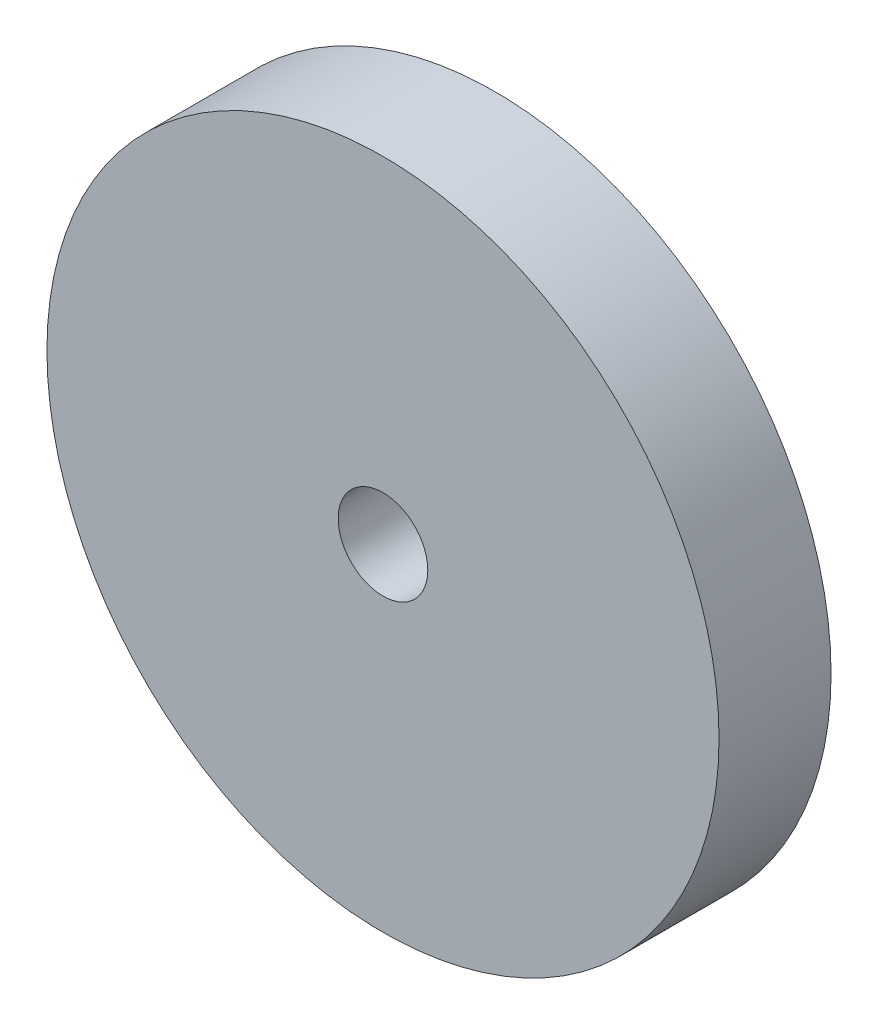
ISO-10303-21;
HEADER;
FILE_DESCRIPTION(('STEP AP214'),'2;1');
FILE_NAME('part.step','',(''),(''),'','','');
FILE_SCHEMA(('AUTOMOTIVE_DESIGN { 1 0 10303 214 1 1 1 1 }'));
ENDSEC;
DATA;
#1=APPLICATION_CONTEXT('core data for automotive mechanical design processes');
#2=APPLICATION_PROTOCOL_DEFINITION('international standard','automotive_design',2000,#1);
#3=PRODUCT_CONTEXT('',#1,'mechanical');
#4=PRODUCT('Part','Part','',(#3));
#5=PRODUCT_RELATED_PRODUCT_CATEGORY('part','',(#4));
#6=PRODUCT_DEFINITION_FORMATION('','',#4);
#7=PRODUCT_DEFINITION_CONTEXT('part definition',#1,'design');
#8=PRODUCT_DEFINITION('design','',#6,#7);
#9=PRODUCT_DEFINITION_SHAPE('','',#8);
#10=(LENGTH_UNIT() NAMED_UNIT(*) SI_UNIT(.MILLI.,.METRE.));
#11=(NAMED_UNIT(*) PLANE_ANGLE_UNIT() SI_UNIT($,.RADIAN.));
#12=(NAMED_UNIT(*) SI_UNIT($,.STERADIAN.) SOLID_ANGLE_UNIT());
#13=UNCERTAINTY_MEASURE_WITH_UNIT(LENGTH_MEASURE(1.E-05),#10,'distance_accuracy_value','');
#14=(GEOMETRIC_REPRESENTATION_CONTEXT(3) GLOBAL_UNCERTAINTY_ASSIGNED_CONTEXT((#13)) GLOBAL_UNIT_ASSIGNED_CONTEXT((#10,
#11,#12)) REPRESENTATION_CONTEXT('',''));
#15=CARTESIAN_POINT('',(0.,0.,0.));
#16=DIRECTION('',(0.,0.,1.));
#17=DIRECTION('',(1.,0.,0.));
#18=AXIS2_PLACEMENT_3D('',#15,#16,#17);
#19=CARTESIAN_POINT('',(0.,0.,50.));
#20=DIRECTION('',(0.,0.,1.));
#21=DIRECTION('',(1.,0.,0.));
#22=AXIS2_PLACEMENT_3D('',#19,#20,#21);
#23=PLANE('',#22);
#24=CARTESIAN_POINT('',(0.,0.,50.));
#25=DIRECTION('',(0.,0.,1.));
#26=DIRECTION('',(1.,0.,0.));
#27=AXIS2_PLACEMENT_3D('',#24,#25,#26);
#28=CIRCLE('',#27,150.);
#29=CARTESIAN_POINT('',(150.,0.,50.));
#30=VERTEX_POINT('',#29);
#31=EDGE_CURVE('E10',#30,#30,#28,.T.);
#32=ORIENTED_EDGE('',*,*,#31,.T.);
#33=EDGE_LOOP('',(#32));
#34=FACE_BOUND('',#33,.T.);
#35=CARTESIAN_POINT('',(0.,0.,50.));
#36=DIRECTION('',(0.,0.,1.));
#37=DIRECTION('',(1.,0.,0.));
#38=AXIS2_PLACEMENT_3D('',#35,#36,#37);
#39=CIRCLE('',#38,20.);
#40=CARTESIAN_POINT('',(20.,0.,50.));
#41=VERTEX_POINT('',#40);
#42=EDGE_CURVE('E46',#41,#41,#39,.T.);
#43=ORIENTED_EDGE('',*,*,#42,.F.);
#44=EDGE_LOOP('',(#43));
#45=FACE_BOUND('',#44,.T.);
#46=ADVANCED_FACE('F35',(#34,#45),#23,.T.);
#47=CARTESIAN_POINT('',(0.,0.,0.));
#48=DIRECTION('',(0.,0.,1.));
#49=DIRECTION('',(1.,0.,0.));
#50=AXIS2_PLACEMENT_3D('',#47,#48,#49);
#51=PLANE('',#50);
#52=CARTESIAN_POINT('',(0.,0.,0.));
#53=DIRECTION('',(0.,0.,1.));
#54=DIRECTION('',(1.,0.,0.));
#55=AXIS2_PLACEMENT_3D('',#52,#53,#54);
#56=CIRCLE('',#55,150.);
#57=CARTESIAN_POINT('',(150.,0.,0.));
#58=VERTEX_POINT('',#57);
#59=EDGE_CURVE('E39',#58,#58,#56,.T.);
#60=ORIENTED_EDGE('',*,*,#59,.F.);
#61=EDGE_LOOP('',(#60));
#62=FACE_BOUND('',#61,.T.);
#63=CARTESIAN_POINT('',(0.,0.,0.));
#64=DIRECTION('',(0.,0.,1.));
#65=DIRECTION('',(1.,0.,0.));
#66=AXIS2_PLACEMENT_3D('',#63,#64,#65);
#67=CIRCLE('',#66,20.);
#68=CARTESIAN_POINT('',(20.,0.,0.));
#69=VERTEX_POINT('',#68);
#70=EDGE_CURVE('E48',#69,#69,#67,.T.);
#71=ORIENTED_EDGE('',*,*,#70,.T.);
#72=EDGE_LOOP('',(#71));
#73=FACE_BOUND('',#72,.T.);
#74=ADVANCED_FACE('F58',(#62,#73),#51,.F.);
#75=CARTESIAN_POINT('',(0.,0.,50.));
#76=DIRECTION('',(0.,0.,-1.));
#77=DIRECTION('',(-1.,0.,0.));
#78=AXIS2_PLACEMENT_3D('',#75,#76,#77);
#79=CYLINDRICAL_SURFACE('',#78,150.);
#80=ORIENTED_EDGE('',*,*,#31,.F.);
#81=EDGE_LOOP('',(#80));
#82=FACE_BOUND('',#81,.T.);
#83=ORIENTED_EDGE('',*,*,#59,.T.);
#84=EDGE_LOOP('',(#83));
#85=FACE_BOUND('',#84,.T.);
#86=ADVANCED_FACE('F37',(#82,#85),#79,.T.);
#87=CARTESIAN_POINT('',(0.,0.,50.));
#88=DIRECTION('',(0.,0.,-1.));
#89=DIRECTION('',(-1.,0.,0.));
#90=AXIS2_PLACEMENT_3D('',#87,#88,#89);
#91=CYLINDRICAL_SURFACE('',#90,20.);
#92=ORIENTED_EDGE('',*,*,#42,.T.);
#93=EDGE_LOOP('',(#92));
#94=FACE_BOUND('',#93,.T.);
#95=ORIENTED_EDGE('',*,*,#70,.F.);
#96=EDGE_LOOP('',(#95));
#97=FACE_BOUND('',#96,.T.);
#98=ADVANCED_FACE('F54',(#94,#97),#91,.F.);
#99=CLOSED_SHELL('',(#46,#74,#86,#98));
#100=MANIFOLD_SOLID_BREP('B2',#99);
#101=ADVANCED_BREP_SHAPE_REPRESENTATION('',(#18,#100),#14);
#102=SHAPE_DEFINITION_REPRESENTATION(#9,#101);
ENDSEC;
END-ISO-10303-21;
